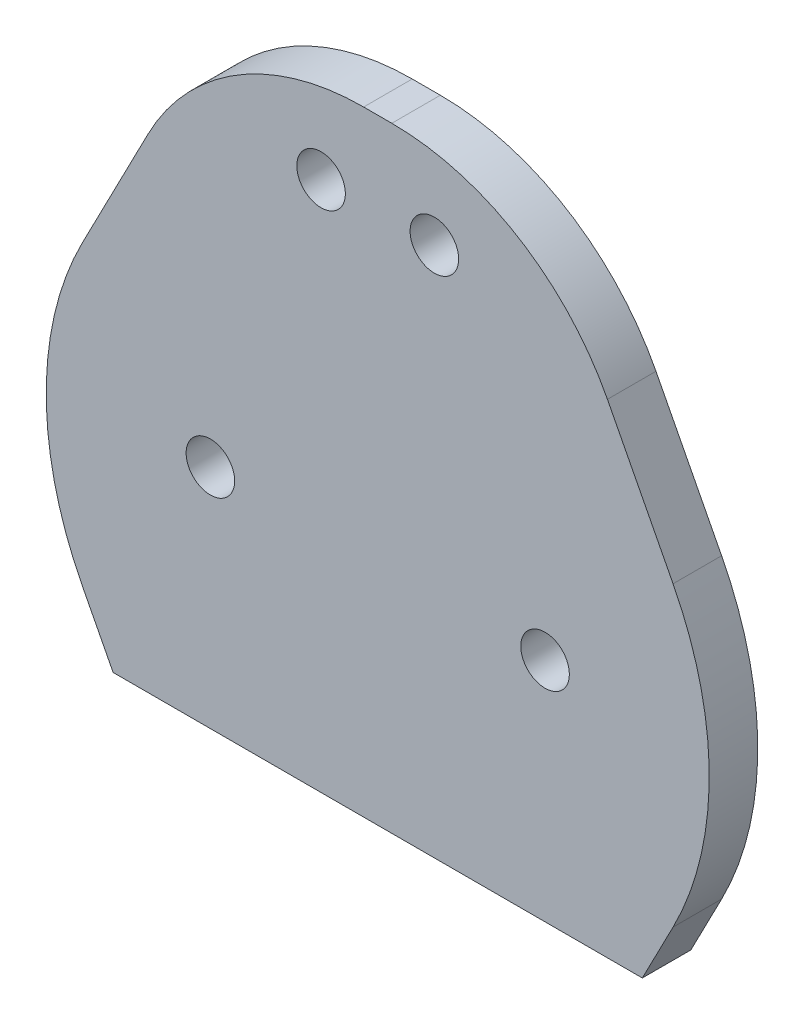
ISO-10303-21;
HEADER;
FILE_DESCRIPTION(('STEP AP214'),'2;1');
FILE_NAME('part.step','',(''),(''),'','','');
FILE_SCHEMA(('AUTOMOTIVE_DESIGN { 1 0 10303 214 1 1 1 1 }'));
ENDSEC;
DATA;
#1=APPLICATION_CONTEXT('core data for automotive mechanical design processes');
#2=APPLICATION_PROTOCOL_DEFINITION('international standard','automotive_design',2000,#1);
#3=PRODUCT_CONTEXT('',#1,'mechanical');
#4=PRODUCT('Part','Part','',(#3));
#5=PRODUCT_RELATED_PRODUCT_CATEGORY('part','',(#4));
#6=PRODUCT_DEFINITION_FORMATION('','',#4);
#7=PRODUCT_DEFINITION_CONTEXT('part definition',#1,'design');
#8=PRODUCT_DEFINITION('design','',#6,#7);
#9=PRODUCT_DEFINITION_SHAPE('','',#8);
#10=(LENGTH_UNIT() NAMED_UNIT(*) SI_UNIT(.MILLI.,.METRE.));
#11=(NAMED_UNIT(*) PLANE_ANGLE_UNIT() SI_UNIT($,.RADIAN.));
#12=(NAMED_UNIT(*) SI_UNIT($,.STERADIAN.) SOLID_ANGLE_UNIT());
#13=UNCERTAINTY_MEASURE_WITH_UNIT(LENGTH_MEASURE(1.E-05),#10,'distance_accuracy_value','');
#14=(GEOMETRIC_REPRESENTATION_CONTEXT(3) GLOBAL_UNCERTAINTY_ASSIGNED_CONTEXT((#13)) GLOBAL_UNIT_ASSIGNED_CONTEXT((#10,
#11,#12)) REPRESENTATION_CONTEXT('',''));
#15=CARTESIAN_POINT('',(0.,0.,0.));
#16=DIRECTION('',(0.,0.,1.));
#17=DIRECTION('',(1.,0.,0.));
#18=AXIS2_PLACEMENT_3D('',#15,#16,#17);
#19=CARTESIAN_POINT('',(0.,0.,3.));
#20=DIRECTION('',(0.,0.,-1.));
#21=DIRECTION('',(-1.,0.,0.));
#22=AXIS2_PLACEMENT_3D('',#19,#20,#21);
#23=PLANE('',#22);
#24=CARTESIAN_POINT('',(-6.84040286651345,18.7938524157181,3.));
#25=DIRECTION('',(0.,0.,1.));
#26=DIRECTION('',(1.,0.,0.));
#27=AXIS2_PLACEMENT_3D('',#24,#25,#26);
#28=CIRCLE('',#27,1.5);
#29=CARTESIAN_POINT('',(-5.34040286651345,18.7938524157181,3.));
#30=VERTEX_POINT('',#29);
#31=EDGE_CURVE('E149',#30,#30,#28,.T.);
#32=ORIENTED_EDGE('',*,*,#31,.F.);
#33=EDGE_LOOP('',(#32));
#34=FACE_BOUND('',#33,.T.);
#35=CARTESIAN_POINT('',(0.,0.,3.));
#36=DIRECTION('',(0.,0.,1.));
#37=DIRECTION('',(1.,0.,0.));
#38=AXIS2_PLACEMENT_3D('',#35,#36,#37);
#39=CIRCLE('',#38,1.5);
#40=CARTESIAN_POINT('',(1.5,0.,3.));
#41=VERTEX_POINT('',#40);
#42=EDGE_CURVE('E225',#41,#41,#39,.T.);
#43=ORIENTED_EDGE('',*,*,#42,.F.);
#44=EDGE_LOOP('',(#43));
#45=FACE_BOUND('',#44,.T.);
#46=CARTESIAN_POINT('',(-20.6808057330269,0.,3.));
#47=DIRECTION('',(0.,0.,1.));
#48=DIRECTION('',(-1.,0.,0.));
#49=AXIS2_PLACEMENT_3D('',#46,#47,#48);
#50=CIRCLE('',#49,1.5);
#51=CARTESIAN_POINT('',(-22.1808057330269,0.,3.));
#52=VERTEX_POINT('',#51);
#53=EDGE_CURVE('E219',#52,#52,#50,.T.);
#54=ORIENTED_EDGE('',*,*,#53,.F.);
#55=EDGE_LOOP('',(#54));
#56=FACE_BOUND('',#55,.T.);
#57=CARTESIAN_POINT('',(-13.8404028665135,18.7938524157181,3.));
#58=DIRECTION('',(0.,0.,1.));
#59=DIRECTION('',(-1.,0.,0.));
#60=AXIS2_PLACEMENT_3D('',#57,#58,#59);
#61=CIRCLE('',#60,1.5);
#62=CARTESIAN_POINT('',(-15.3404028665135,18.7938524157181,3.));
#63=VERTEX_POINT('',#62);
#64=EDGE_CURVE('E213',#63,#63,#61,.T.);
#65=ORIENTED_EDGE('',*,*,#64,.F.);
#66=EDGE_LOOP('',(#65));
#67=FACE_BOUND('',#66,.T.);
#68=DIRECTION('',(-0.459332414669423,-0.888264449831219,0.));
#69=VECTOR('',#68,1.);
#70=CARTESIAN_POINT('',(-25.8410649035978,13.3627308196948,3.));
#71=LINE('',#70,#69);
#72=CARTESIAN_POINT('',(-24.534190215831,15.8899862200413,3.));
#73=VERTEX_POINT('',#72);
#74=CARTESIAN_POINT('',(-28.5898746379857,8.04703811343539,3.));
#75=VERTEX_POINT('',#74);
#76=EDGE_CURVE('E196',#73,#75,#71,.T.);
#77=ORIENTED_EDGE('',*,*,#76,.T.);
#78=CARTESIAN_POINT('',(-10.8245856413614,-1.13961017995307,3.));
#79=DIRECTION('',(0.,0.,-1.));
#80=DIRECTION('',(-1.,0.,0.));
#81=AXIS2_PLACEMENT_3D('',#78,#79,#80);
#82=CIRCLE('',#81,20.);
#83=CARTESIAN_POINT('',(-28.5898746379857,-10.3262584733415,3.));
#84=VERTEX_POINT('',#83);
#85=EDGE_CURVE('E75',#75,#84,#82,.F.);
#86=ORIENTED_EDGE('',*,*,#85,.T.);
#87=DIRECTION('',(0.459332414669423,-0.888264449831219,0.));
#88=VECTOR('',#87,1.);
#89=CARTESIAN_POINT('',(-26.7710065361937,-13.8436150154802,3.));
#90=LINE('',#89,#88);
#91=CARTESIAN_POINT('',(-26.6901379473729,-14.,3.));
#92=VERTEX_POINT('',#91);
#93=EDGE_CURVE('E134',#84,#92,#90,.T.);
#94=ORIENTED_EDGE('',*,*,#93,.T.);
#95=DIRECTION('',(1.,0.,0.));
#96=VECTOR('',#95,1.);
#97=CARTESIAN_POINT('',(12.6595971334865,-14.,3.));
#98=LINE('',#97,#96);
#99=CARTESIAN_POINT('',(6.009332214346,-14.,3.));
#100=VERTEX_POINT('',#99);
#101=EDGE_CURVE('E141',#92,#100,#98,.T.);
#102=ORIENTED_EDGE('',*,*,#101,.T.);
#103=DIRECTION('',(0.459332414669423,0.888264449831218,0.));
#104=VECTOR('',#103,1.);
#105=CARTESIAN_POINT('',(10.4535668067642,-5.40566729218029,3.));
#106=LINE('',#105,#104);
#107=CARTESIAN_POINT('',(7.90906890495882,-10.3262584733415,3.));
#108=VERTEX_POINT('',#107);
#109=EDGE_CURVE('E209',#100,#108,#106,.T.);
#110=ORIENTED_EDGE('',*,*,#109,.T.);
#111=CARTESIAN_POINT('',(-9.85622009166555,-1.13961017995306,3.));
#112=DIRECTION('',(0.,0.,-1.));
#113=DIRECTION('',(-1.,0.,0.));
#114=AXIS2_PLACEMENT_3D('',#111,#112,#113);
#115=CIRCLE('',#114,20.);
#116=CARTESIAN_POINT('',(7.90906890495882,8.0470381134354,3.));
#117=VERTEX_POINT('',#116);
#118=EDGE_CURVE('E182',#108,#117,#115,.F.);
#119=ORIENTED_EDGE('',*,*,#118,.T.);
#120=DIRECTION('',(-0.459332414669423,0.888264449831219,0.));
#121=VECTOR('',#120,1.);
#122=CARTESIAN_POINT('',(9.52362517416836,4.92478309639485,3.));
#123=LINE('',#122,#121);
#124=CARTESIAN_POINT('',(3.85338448280413,15.8899862200413,3.));
#125=VERTEX_POINT('',#124);
#126=EDGE_CURVE('E142',#117,#125,#123,.T.);
#127=ORIENTED_EDGE('',*,*,#126,.T.);
#128=CARTESIAN_POINT('',(-9.47058226466415,9.,3.));
#129=DIRECTION('',(0.,0.,-1.));
#130=DIRECTION('',(-1.,0.,0.));
#131=AXIS2_PLACEMENT_3D('',#128,#129,#130);
#132=CIRCLE('',#131,15.);
#133=CARTESIAN_POINT('',(-9.47058226466415,24.,3.));
#134=VERTEX_POINT('',#133);
#135=EDGE_CURVE('E163',#125,#134,#132,.F.);
#136=ORIENTED_EDGE('',*,*,#135,.T.);
#137=DIRECTION('',(-1.,0.,0.));
#138=VECTOR('',#137,1.);
#139=CARTESIAN_POINT('',(-33.3404028665135,24.,3.));
#140=LINE('',#139,#138);
#141=CARTESIAN_POINT('',(-11.2102234683628,24.,3.));
#142=VERTEX_POINT('',#141);
#143=EDGE_CURVE('E157',#134,#142,#140,.T.);
#144=ORIENTED_EDGE('',*,*,#143,.T.);
#145=CARTESIAN_POINT('',(-11.2102234683628,9.,3.));
#146=DIRECTION('',(0.,0.,-1.));
#147=DIRECTION('',(-1.,0.,0.));
#148=AXIS2_PLACEMENT_3D('',#145,#146,#147);
#149=CIRCLE('',#148,15.);
#150=EDGE_CURVE('E173',#142,#73,#149,.F.);
#151=ORIENTED_EDGE('',*,*,#150,.T.);
#152=EDGE_LOOP('',(#77,#86,#94,#102,#110,#119,#127,#136,#144,#151));
#153=FACE_BOUND('',#152,.T.);
#154=ADVANCED_FACE('F53',(#34,#45,#56,#67,#153),#23,.F.);
#155=CARTESIAN_POINT('',(0.,0.,0.));
#156=DIRECTION('',(0.,0.,-1.));
#157=DIRECTION('',(-1.,0.,0.));
#158=AXIS2_PLACEMENT_3D('',#155,#156,#157);
#159=PLANE('',#158);
#160=CARTESIAN_POINT('',(-20.6808057330269,0.,0.));
#161=DIRECTION('',(0.,0.,1.));
#162=DIRECTION('',(-1.,0.,0.));
#163=AXIS2_PLACEMENT_3D('',#160,#161,#162);
#164=CIRCLE('',#163,1.5);
#165=CARTESIAN_POINT('',(-22.1808057330269,0.,0.));
#166=VERTEX_POINT('',#165);
#167=EDGE_CURVE('E216',#166,#166,#164,.T.);
#168=ORIENTED_EDGE('',*,*,#167,.T.);
#169=EDGE_LOOP('',(#168));
#170=FACE_BOUND('',#169,.T.);
#171=CARTESIAN_POINT('',(-6.84040286651345,18.7938524157181,0.));
#172=DIRECTION('',(0.,0.,1.));
#173=DIRECTION('',(1.,0.,0.));
#174=AXIS2_PLACEMENT_3D('',#171,#172,#173);
#175=CIRCLE('',#174,1.5);
#176=CARTESIAN_POINT('',(-5.34040286651345,18.7938524157181,0.));
#177=VERTEX_POINT('',#176);
#178=EDGE_CURVE('E154',#177,#177,#175,.T.);
#179=ORIENTED_EDGE('',*,*,#178,.T.);
#180=EDGE_LOOP('',(#179));
#181=FACE_BOUND('',#180,.T.);
#182=CARTESIAN_POINT('',(0.,0.,0.));
#183=DIRECTION('',(0.,0.,1.));
#184=DIRECTION('',(1.,0.,0.));
#185=AXIS2_PLACEMENT_3D('',#182,#183,#184);
#186=CIRCLE('',#185,1.5);
#187=CARTESIAN_POINT('',(1.5,0.,0.));
#188=VERTEX_POINT('',#187);
#189=EDGE_CURVE('E222',#188,#188,#186,.T.);
#190=ORIENTED_EDGE('',*,*,#189,.T.);
#191=EDGE_LOOP('',(#190));
#192=FACE_BOUND('',#191,.T.);
#193=CARTESIAN_POINT('',(-13.8404028665135,18.7938524157181,0.));
#194=DIRECTION('',(0.,0.,1.));
#195=DIRECTION('',(-1.,0.,0.));
#196=AXIS2_PLACEMENT_3D('',#193,#194,#195);
#197=CIRCLE('',#196,1.5);
#198=CARTESIAN_POINT('',(-15.3404028665135,18.7938524157181,0.));
#199=VERTEX_POINT('',#198);
#200=EDGE_CURVE('E204',#199,#199,#197,.T.);
#201=ORIENTED_EDGE('',*,*,#200,.T.);
#202=EDGE_LOOP('',(#201));
#203=FACE_BOUND('',#202,.T.);
#204=DIRECTION('',(0.459332414669423,-0.888264449831219,0.));
#205=VECTOR('',#204,1.);
#206=CARTESIAN_POINT('',(-26.7710065361937,-13.8436150154802,0.));
#207=LINE('',#206,#205);
#208=CARTESIAN_POINT('',(-28.5898746379857,-10.3262584733415,0.));
#209=VERTEX_POINT('',#208);
#210=CARTESIAN_POINT('',(-26.6901379473729,-14.,0.));
#211=VERTEX_POINT('',#210);
#212=EDGE_CURVE('E126',#209,#211,#207,.T.);
#213=ORIENTED_EDGE('',*,*,#212,.F.);
#214=CARTESIAN_POINT('',(-10.8245856413614,-1.13961017995307,0.));
#215=DIRECTION('',(0.,0.,-1.));
#216=DIRECTION('',(-1.,0.,0.));
#217=AXIS2_PLACEMENT_3D('',#214,#215,#216);
#218=CIRCLE('',#217,20.);
#219=CARTESIAN_POINT('',(-28.5898746379857,8.04703811343539,0.));
#220=VERTEX_POINT('',#219);
#221=EDGE_CURVE('E12',#209,#220,#218,.T.);
#222=ORIENTED_EDGE('',*,*,#221,.T.);
#223=DIRECTION('',(-0.459332414669423,-0.888264449831219,0.));
#224=VECTOR('',#223,1.);
#225=CARTESIAN_POINT('',(-25.8410649035978,13.3627308196948,0.));
#226=LINE('',#225,#224);
#227=CARTESIAN_POINT('',(-24.534190215831,15.8899862200413,0.));
#228=VERTEX_POINT('',#227);
#229=EDGE_CURVE('E199',#228,#220,#226,.T.);
#230=ORIENTED_EDGE('',*,*,#229,.F.);
#231=CARTESIAN_POINT('',(-11.2102234683628,9.,0.));
#232=DIRECTION('',(0.,0.,-1.));
#233=DIRECTION('',(-1.,0.,0.));
#234=AXIS2_PLACEMENT_3D('',#231,#232,#233);
#235=CIRCLE('',#234,15.);
#236=CARTESIAN_POINT('',(-11.2102234683628,24.,0.));
#237=VERTEX_POINT('',#236);
#238=EDGE_CURVE('E177',#228,#237,#235,.T.);
#239=ORIENTED_EDGE('',*,*,#238,.T.);
#240=DIRECTION('',(-1.,0.,0.));
#241=VECTOR('',#240,1.);
#242=CARTESIAN_POINT('',(-33.3404028665135,24.,0.));
#243=LINE('',#242,#241);
#244=CARTESIAN_POINT('',(-9.47058226466415,24.,0.));
#245=VERTEX_POINT('',#244);
#246=EDGE_CURVE('E148',#245,#237,#243,.T.);
#247=ORIENTED_EDGE('',*,*,#246,.F.);
#248=CARTESIAN_POINT('',(-9.47058226466415,9.,0.));
#249=DIRECTION('',(0.,0.,-1.));
#250=DIRECTION('',(-1.,0.,0.));
#251=AXIS2_PLACEMENT_3D('',#248,#249,#250);
#252=CIRCLE('',#251,15.);
#253=CARTESIAN_POINT('',(3.85338448280413,15.8899862200413,0.));
#254=VERTEX_POINT('',#253);
#255=EDGE_CURVE('E167',#245,#254,#252,.T.);
#256=ORIENTED_EDGE('',*,*,#255,.T.);
#257=DIRECTION('',(-0.459332414669423,0.888264449831219,0.));
#258=VECTOR('',#257,1.);
#259=CARTESIAN_POINT('',(9.52362517416836,4.92478309639485,0.));
#260=LINE('',#259,#258);
#261=CARTESIAN_POINT('',(7.90906890495882,8.0470381134354,0.));
#262=VERTEX_POINT('',#261);
#263=EDGE_CURVE('E211',#262,#254,#260,.T.);
#264=ORIENTED_EDGE('',*,*,#263,.F.);
#265=CARTESIAN_POINT('',(-9.85622009166555,-1.13961017995306,0.));
#266=DIRECTION('',(0.,0.,-1.));
#267=DIRECTION('',(-1.,0.,0.));
#268=AXIS2_PLACEMENT_3D('',#265,#266,#267);
#269=CIRCLE('',#268,20.);
#270=CARTESIAN_POINT('',(7.90906890495882,-10.3262584733415,0.));
#271=VERTEX_POINT('',#270);
#272=EDGE_CURVE('E186',#262,#271,#269,.T.);
#273=ORIENTED_EDGE('',*,*,#272,.T.);
#274=DIRECTION('',(0.459332414669423,0.888264449831218,0.));
#275=VECTOR('',#274,1.);
#276=CARTESIAN_POINT('',(10.4535668067642,-5.40566729218029,0.));
#277=LINE('',#276,#275);
#278=CARTESIAN_POINT('',(6.009332214346,-14.,0.));
#279=VERTEX_POINT('',#278);
#280=EDGE_CURVE('E147',#279,#271,#277,.T.);
#281=ORIENTED_EDGE('',*,*,#280,.F.);
#282=DIRECTION('',(1.,0.,0.));
#283=VECTOR('',#282,1.);
#284=CARTESIAN_POINT('',(12.6595971334865,-14.,0.));
#285=LINE('',#284,#283);
#286=EDGE_CURVE('E139',#211,#279,#285,.T.);
#287=ORIENTED_EDGE('',*,*,#286,.F.);
#288=EDGE_LOOP('',(#213,#222,#230,#239,#247,#256,#264,#273,#281,#287));
#289=FACE_BOUND('',#288,.T.);
#290=ADVANCED_FACE('F145',(#170,#181,#192,#203,#289),#159,.T.);
#291=CARTESIAN_POINT('',(12.6595971334865,-14.,3.));
#292=DIRECTION('',(0.,1.,0.));
#293=DIRECTION('',(-1.,0.,0.));
#294=AXIS2_PLACEMENT_3D('',#291,#292,#293);
#295=PLANE('',#294);
#296=DIRECTION('',(0.,0.,1.));
#297=VECTOR('',#296,1.);
#298=CARTESIAN_POINT('',(-26.6901379473729,-14.,0.));
#299=LINE('',#298,#297);
#300=EDGE_CURVE('E129',#211,#92,#299,.T.);
#301=ORIENTED_EDGE('',*,*,#300,.F.);
#302=ORIENTED_EDGE('',*,*,#286,.T.);
#303=DIRECTION('',(0.,0.,1.));
#304=VECTOR('',#303,1.);
#305=CARTESIAN_POINT('',(6.009332214346,-14.,0.));
#306=LINE('',#305,#304);
#307=EDGE_CURVE('E202',#279,#100,#306,.T.);
#308=ORIENTED_EDGE('',*,*,#307,.T.);
#309=ORIENTED_EDGE('',*,*,#101,.F.);
#310=EDGE_LOOP('',(#301,#302,#308,#309));
#311=FACE_BOUND('',#310,.T.);
#312=ADVANCED_FACE('F137',(#311),#295,.F.);
#313=CARTESIAN_POINT('',(-33.3404028665135,24.,3.));
#314=DIRECTION('',(0.,-1.,0.));
#315=DIRECTION('',(1.,0.,0.));
#316=AXIS2_PLACEMENT_3D('',#313,#314,#315);
#317=PLANE('',#316);
#318=ORIENTED_EDGE('',*,*,#246,.T.);
#319=DIRECTION('',(0.,0.,1.));
#320=VECTOR('',#319,1.);
#321=CARTESIAN_POINT('',(-11.2102234683628,24.,3.));
#322=LINE('',#321,#320);
#323=EDGE_CURVE('E170',#237,#142,#322,.T.);
#324=ORIENTED_EDGE('',*,*,#323,.T.);
#325=ORIENTED_EDGE('',*,*,#143,.F.);
#326=DIRECTION('',(0.,0.,1.));
#327=VECTOR('',#326,1.);
#328=CARTESIAN_POINT('',(-9.47058226466415,24.,0.));
#329=LINE('',#328,#327);
#330=EDGE_CURVE('E165',#134,#245,#329,.F.);
#331=ORIENTED_EDGE('',*,*,#330,.T.);
#332=EDGE_LOOP('',(#318,#324,#325,#331));
#333=FACE_BOUND('',#332,.T.);
#334=ADVANCED_FACE('F236',(#333),#317,.F.);
#335=CARTESIAN_POINT('',(-6.84040286651345,18.7938524157181,3.));
#336=DIRECTION('',(0.,0.,-1.));
#337=DIRECTION('',(-1.,0.,0.));
#338=AXIS2_PLACEMENT_3D('',#335,#336,#337);
#339=CYLINDRICAL_SURFACE('',#338,1.5);
#340=ORIENTED_EDGE('',*,*,#31,.T.);
#341=EDGE_LOOP('',(#340));
#342=FACE_BOUND('',#341,.T.);
#343=ORIENTED_EDGE('',*,*,#178,.F.);
#344=EDGE_LOOP('',(#343));
#345=FACE_BOUND('',#344,.T.);
#346=ADVANCED_FACE('F265',(#342,#345),#339,.F.);
#347=CARTESIAN_POINT('',(0.,0.,3.));
#348=DIRECTION('',(0.,0.,-1.));
#349=DIRECTION('',(-1.,0.,0.));
#350=AXIS2_PLACEMENT_3D('',#347,#348,#349);
#351=CYLINDRICAL_SURFACE('',#350,1.5);
#352=ORIENTED_EDGE('',*,*,#42,.T.);
#353=EDGE_LOOP('',(#352));
#354=FACE_BOUND('',#353,.T.);
#355=ORIENTED_EDGE('',*,*,#189,.F.);
#356=EDGE_LOOP('',(#355));
#357=FACE_BOUND('',#356,.T.);
#358=ADVANCED_FACE('F347',(#354,#357),#351,.F.);
#359=CARTESIAN_POINT('',(-20.6808057330269,0.,3.));
#360=DIRECTION('',(0.,0.,-1.));
#361=DIRECTION('',(-1.,0.,0.));
#362=AXIS2_PLACEMENT_3D('',#359,#360,#361);
#363=CYLINDRICAL_SURFACE('',#362,1.5);
#364=ORIENTED_EDGE('',*,*,#53,.T.);
#365=EDGE_LOOP('',(#364));
#366=FACE_BOUND('',#365,.T.);
#367=ORIENTED_EDGE('',*,*,#167,.F.);
#368=EDGE_LOOP('',(#367));
#369=FACE_BOUND('',#368,.T.);
#370=ADVANCED_FACE('F344',(#366,#369),#363,.F.);
#371=CARTESIAN_POINT('',(-13.8404028665135,18.7938524157181,3.));
#372=DIRECTION('',(0.,0.,-1.));
#373=DIRECTION('',(-1.,0.,0.));
#374=AXIS2_PLACEMENT_3D('',#371,#372,#373);
#375=CYLINDRICAL_SURFACE('',#374,1.5);
#376=ORIENTED_EDGE('',*,*,#64,.T.);
#377=EDGE_LOOP('',(#376));
#378=FACE_BOUND('',#377,.T.);
#379=ORIENTED_EDGE('',*,*,#200,.F.);
#380=EDGE_LOOP('',(#379));
#381=FACE_BOUND('',#380,.T.);
#382=ADVANCED_FACE('F313',(#378,#381),#375,.F.);
#383=CARTESIAN_POINT('',(-25.8410649035978,13.3627308196948,0.));
#384=DIRECTION('',(-0.888264449831219,0.459332414669423,0.));
#385=DIRECTION('',(-0.459332414669423,-0.888264449831219,0.));
#386=AXIS2_PLACEMENT_3D('',#383,#384,#385);
#387=PLANE('',#386);
#388=ORIENTED_EDGE('',*,*,#229,.T.);
#389=DIRECTION('',(0.,0.,1.));
#390=VECTOR('',#389,1.);
#391=CARTESIAN_POINT('',(-28.5898746379857,8.04703811343539,0.));
#392=LINE('',#391,#390);
#393=EDGE_CURVE('E188',#220,#75,#392,.T.);
#394=ORIENTED_EDGE('',*,*,#393,.T.);
#395=ORIENTED_EDGE('',*,*,#76,.F.);
#396=DIRECTION('',(0.,0.,1.));
#397=VECTOR('',#396,1.);
#398=CARTESIAN_POINT('',(-24.534190215831,15.8899862200413,0.));
#399=LINE('',#398,#397);
#400=EDGE_CURVE('E175',#73,#228,#399,.F.);
#401=ORIENTED_EDGE('',*,*,#400,.T.);
#402=EDGE_LOOP('',(#388,#394,#395,#401));
#403=FACE_BOUND('',#402,.T.);
#404=ADVANCED_FACE('F195',(#403),#387,.T.);
#405=CARTESIAN_POINT('',(10.4535668067642,-5.40566729218029,0.));
#406=DIRECTION('',(0.888264449831218,-0.459332414669423,0.));
#407=DIRECTION('',(0.459332414669423,0.888264449831219,0.));
#408=AXIS2_PLACEMENT_3D('',#405,#406,#407);
#409=PLANE('',#408);
#410=ORIENTED_EDGE('',*,*,#280,.T.);
#411=DIRECTION('',(0.,0.,1.));
#412=VECTOR('',#411,1.);
#413=CARTESIAN_POINT('',(7.90906890495882,-10.3262584733415,0.));
#414=LINE('',#413,#412);
#415=EDGE_CURVE('E179',#271,#108,#414,.T.);
#416=ORIENTED_EDGE('',*,*,#415,.T.);
#417=ORIENTED_EDGE('',*,*,#109,.F.);
#418=ORIENTED_EDGE('',*,*,#307,.F.);
#419=EDGE_LOOP('',(#410,#416,#417,#418));
#420=FACE_BOUND('',#419,.T.);
#421=ADVANCED_FACE('F312',(#420),#409,.T.);
#422=CARTESIAN_POINT('',(9.52362517416836,4.92478309639485,0.));
#423=DIRECTION('',(0.888264449831219,0.459332414669423,0.));
#424=DIRECTION('',(-0.459332414669423,0.888264449831219,0.));
#425=AXIS2_PLACEMENT_3D('',#422,#423,#424);
#426=PLANE('',#425);
#427=ORIENTED_EDGE('',*,*,#126,.F.);
#428=DIRECTION('',(0.,0.,1.));
#429=VECTOR('',#428,1.);
#430=CARTESIAN_POINT('',(7.90906890495882,8.0470381134354,0.));
#431=LINE('',#430,#429);
#432=EDGE_CURVE('E184',#117,#262,#431,.F.);
#433=ORIENTED_EDGE('',*,*,#432,.T.);
#434=ORIENTED_EDGE('',*,*,#263,.T.);
#435=DIRECTION('',(0.,0.,1.));
#436=VECTOR('',#435,1.);
#437=CARTESIAN_POINT('',(3.85338448280413,15.8899862200413,3.));
#438=LINE('',#437,#436);
#439=EDGE_CURVE('E160',#254,#125,#438,.T.);
#440=ORIENTED_EDGE('',*,*,#439,.T.);
#441=EDGE_LOOP('',(#427,#433,#434,#440));
#442=FACE_BOUND('',#441,.T.);
#443=ADVANCED_FACE('F292',(#442),#426,.T.);
#444=CARTESIAN_POINT('',(-26.7710065361937,-13.8436150154802,0.));
#445=DIRECTION('',(-0.888264449831218,-0.459332414669423,0.));
#446=DIRECTION('',(0.459332414669423,-0.888264449831219,0.));
#447=AXIS2_PLACEMENT_3D('',#444,#445,#446);
#448=PLANE('',#447);
#449=ORIENTED_EDGE('',*,*,#93,.F.);
#450=DIRECTION('',(0.,0.,1.));
#451=VECTOR('',#450,1.);
#452=CARTESIAN_POINT('',(-28.5898746379857,-10.3262584733415,0.));
#453=LINE('',#452,#451);
#454=EDGE_CURVE('E61',#84,#209,#453,.F.);
#455=ORIENTED_EDGE('',*,*,#454,.T.);
#456=ORIENTED_EDGE('',*,*,#212,.T.);
#457=ORIENTED_EDGE('',*,*,#300,.T.);
#458=EDGE_LOOP('',(#449,#455,#456,#457));
#459=FACE_BOUND('',#458,.T.);
#460=ADVANCED_FACE('F128',(#459),#448,.T.);
#461=CARTESIAN_POINT('',(-9.47058226466415,9.,0.));
#462=DIRECTION('',(0.,0.,-1.));
#463=DIRECTION('',(-1.,0.,0.));
#464=AXIS2_PLACEMENT_3D('',#461,#462,#463);
#465=CYLINDRICAL_SURFACE('',#464,15.);
#466=ORIENTED_EDGE('',*,*,#255,.F.);
#467=ORIENTED_EDGE('',*,*,#330,.F.);
#468=ORIENTED_EDGE('',*,*,#135,.F.);
#469=ORIENTED_EDGE('',*,*,#439,.F.);
#470=EDGE_LOOP('',(#466,#467,#468,#469));
#471=FACE_BOUND('',#470,.T.);
#472=ADVANCED_FACE('F241',(#471),#465,.T.);
#473=CARTESIAN_POINT('',(-11.2102234683628,9.,3.));
#474=DIRECTION('',(0.,0.,-1.));
#475=DIRECTION('',(-1.,0.,0.));
#476=AXIS2_PLACEMENT_3D('',#473,#474,#475);
#477=CYLINDRICAL_SURFACE('',#476,15.);
#478=ORIENTED_EDGE('',*,*,#238,.F.);
#479=ORIENTED_EDGE('',*,*,#400,.F.);
#480=ORIENTED_EDGE('',*,*,#150,.F.);
#481=ORIENTED_EDGE('',*,*,#323,.F.);
#482=EDGE_LOOP('',(#478,#479,#480,#481));
#483=FACE_BOUND('',#482,.T.);
#484=ADVANCED_FACE('F247',(#483),#477,.T.);
#485=CARTESIAN_POINT('',(-9.85622009166555,-1.13961017995306,0.));
#486=DIRECTION('',(0.,0.,1.));
#487=DIRECTION('',(1.,0.,0.));
#488=AXIS2_PLACEMENT_3D('',#485,#486,#487);
#489=CYLINDRICAL_SURFACE('',#488,20.);
#490=ORIENTED_EDGE('',*,*,#272,.F.);
#491=ORIENTED_EDGE('',*,*,#432,.F.);
#492=ORIENTED_EDGE('',*,*,#118,.F.);
#493=ORIENTED_EDGE('',*,*,#415,.F.);
#494=EDGE_LOOP('',(#490,#491,#492,#493));
#495=FACE_BOUND('',#494,.T.);
#496=ADVANCED_FACE('F249',(#495),#489,.T.);
#497=CARTESIAN_POINT('',(-10.8245856413614,-1.13961017995307,0.));
#498=DIRECTION('',(0.,0.,1.));
#499=DIRECTION('',(1.,0.,0.));
#500=AXIS2_PLACEMENT_3D('',#497,#498,#499);
#501=CYLINDRICAL_SURFACE('',#500,20.);
#502=ORIENTED_EDGE('',*,*,#221,.F.);
#503=ORIENTED_EDGE('',*,*,#454,.F.);
#504=ORIENTED_EDGE('',*,*,#85,.F.);
#505=ORIENTED_EDGE('',*,*,#393,.F.);
#506=EDGE_LOOP('',(#502,#503,#504,#505));
#507=FACE_BOUND('',#506,.T.);
#508=ADVANCED_FACE('F55',(#507),#501,.T.);
#509=CLOSED_SHELL('',(#154,#290,#312,#334,#346,#358,#370,#382,#404,#421,#443,#460,#472,#484,
#496,#508));
#510=MANIFOLD_SOLID_BREP('B2',#509);
#511=ADVANCED_BREP_SHAPE_REPRESENTATION('',(#18,#510),#14);
#512=SHAPE_DEFINITION_REPRESENTATION(#9,#511);
ENDSEC;
END-ISO-10303-21;
